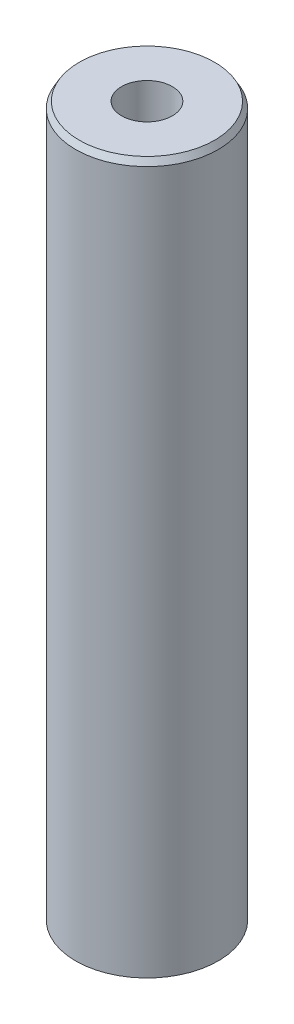
ISO-10303-21;
HEADER;
FILE_DESCRIPTION(('STEP AP214'),'2;1');
FILE_NAME('part.step','',(''),(''),'','','');
FILE_SCHEMA(('AUTOMOTIVE_DESIGN { 1 0 10303 214 1 1 1 1 }'));
ENDSEC;
DATA;
#1=APPLICATION_CONTEXT('core data for automotive mechanical design processes');
#2=APPLICATION_PROTOCOL_DEFINITION('international standard','automotive_design',2000,#1);
#3=PRODUCT_CONTEXT('',#1,'mechanical');
#4=PRODUCT('Part','Part','',(#3));
#5=PRODUCT_RELATED_PRODUCT_CATEGORY('part','',(#4));
#6=PRODUCT_DEFINITION_FORMATION('','',#4);
#7=PRODUCT_DEFINITION_CONTEXT('part definition',#1,'design');
#8=PRODUCT_DEFINITION('design','',#6,#7);
#9=PRODUCT_DEFINITION_SHAPE('','',#8);
#10=(LENGTH_UNIT() NAMED_UNIT(*) SI_UNIT(.MILLI.,.METRE.));
#11=(NAMED_UNIT(*) PLANE_ANGLE_UNIT() SI_UNIT($,.RADIAN.));
#12=(NAMED_UNIT(*) SI_UNIT($,.STERADIAN.) SOLID_ANGLE_UNIT());
#13=UNCERTAINTY_MEASURE_WITH_UNIT(LENGTH_MEASURE(1.E-05),#10,'distance_accuracy_value','');
#14=(GEOMETRIC_REPRESENTATION_CONTEXT(3) GLOBAL_UNCERTAINTY_ASSIGNED_CONTEXT((#13)) GLOBAL_UNIT_ASSIGNED_CONTEXT((#10,
#11,#12)) REPRESENTATION_CONTEXT('',''));
#15=CARTESIAN_POINT('',(0.,0.,0.));
#16=DIRECTION('',(0.,0.,1.));
#17=DIRECTION('',(1.,0.,0.));
#18=AXIS2_PLACEMENT_3D('',#15,#16,#17);
#19=CARTESIAN_POINT('',(0.,600.,0.));
#20=DIRECTION('',(0.,-1.,0.));
#21=DIRECTION('',(0.,0.,-1.));
#22=AXIS2_PLACEMENT_3D('',#19,#20,#21);
#23=CYLINDRICAL_SURFACE('',#22,60.);
#24=CARTESIAN_POINT('',(0.,594.709303964227,0.));
#25=DIRECTION('',(0.,1.,0.));
#26=DIRECTION('',(0.,0.,1.));
#27=AXIS2_PLACEMENT_3D('',#24,#25,#26);
#28=CIRCLE('',#27,60.);
#29=CARTESIAN_POINT('',(0.,594.709303964227,60.));
#30=VERTEX_POINT('',#29);
#31=EDGE_CURVE('E50',#30,#30,#28,.F.);
#32=ORIENTED_EDGE('',*,*,#31,.T.);
#33=EDGE_LOOP('',(#32));
#34=FACE_BOUND('',#33,.T.);
#35=CARTESIAN_POINT('',(0.,3.05458478045362,0.));
#36=DIRECTION('',(0.,1.,0.));
#37=DIRECTION('',(0.,0.,1.));
#38=AXIS2_PLACEMENT_3D('',#35,#36,#37);
#39=CIRCLE('',#38,60.);
#40=CARTESIAN_POINT('',(0.,3.05458478045362,60.));
#41=VERTEX_POINT('',#40);
#42=EDGE_CURVE('E51',#41,#41,#39,.T.);
#43=ORIENTED_EDGE('',*,*,#42,.T.);
#44=EDGE_LOOP('',(#43));
#45=FACE_BOUND('',#44,.T.);
#46=ADVANCED_FACE('F39',(#34,#45),#23,.T.);
#47=CARTESIAN_POINT('',(0.,600.,0.));
#48=DIRECTION('',(0.,1.,0.));
#49=DIRECTION('',(0.,0.,1.));
#50=AXIS2_PLACEMENT_3D('',#47,#48,#49);
#51=PLANE('',#50);
#52=CARTESIAN_POINT('',(0.,600.,0.));
#53=DIRECTION('',(0.,1.,0.));
#54=DIRECTION('',(0.,0.,1.));
#55=AXIS2_PLACEMENT_3D('',#52,#53,#54);
#56=CIRCLE('',#55,56.9454152195462);
#57=CARTESIAN_POINT('',(0.,600.,56.9454152195462));
#58=VERTEX_POINT('',#57);
#59=EDGE_CURVE('E54',#58,#58,#56,.T.);
#60=ORIENTED_EDGE('',*,*,#59,.T.);
#61=EDGE_LOOP('',(#60));
#62=FACE_BOUND('',#61,.T.);
#63=CARTESIAN_POINT('',(0.,600.,0.));
#64=DIRECTION('',(0.,1.,0.));
#65=DIRECTION('',(0.,0.,1.));
#66=AXIS2_PLACEMENT_3D('',#63,#64,#65);
#67=CIRCLE('',#66,21.3816097205668);
#68=CARTESIAN_POINT('',(0.,600.,21.3816097205668));
#69=VERTEX_POINT('',#68);
#70=EDGE_CURVE('E58',#69,#69,#67,.T.);
#71=ORIENTED_EDGE('',*,*,#70,.F.);
#72=EDGE_LOOP('',(#71));
#73=FACE_BOUND('',#72,.T.);
#74=ADVANCED_FACE('F69',(#62,#73),#51,.T.);
#75=CARTESIAN_POINT('',(0.,0.,0.));
#76=DIRECTION('',(0.,1.,0.));
#77=DIRECTION('',(0.,0.,1.));
#78=AXIS2_PLACEMENT_3D('',#75,#76,#77);
#79=PLANE('',#78);
#80=CARTESIAN_POINT('',(0.,0.,0.));
#81=DIRECTION('',(0.,1.,0.));
#82=DIRECTION('',(0.,0.,1.));
#83=AXIS2_PLACEMENT_3D('',#80,#81,#82);
#84=CIRCLE('',#83,54.7093039642276);
#85=CARTESIAN_POINT('',(0.,0.,54.7093039642276));
#86=VERTEX_POINT('',#85);
#87=EDGE_CURVE('E10',#86,#86,#84,.F.);
#88=ORIENTED_EDGE('',*,*,#87,.T.);
#89=EDGE_LOOP('',(#88));
#90=FACE_BOUND('',#89,.T.);
#91=CARTESIAN_POINT('',(0.,0.,0.));
#92=DIRECTION('',(0.,1.,0.));
#93=DIRECTION('',(0.,0.,1.));
#94=AXIS2_PLACEMENT_3D('',#91,#92,#93);
#95=CIRCLE('',#94,21.3816097205668);
#96=CARTESIAN_POINT('',(0.,0.,21.3816097205668));
#97=VERTEX_POINT('',#96);
#98=EDGE_CURVE('E63',#97,#97,#95,.T.);
#99=ORIENTED_EDGE('',*,*,#98,.T.);
#100=EDGE_LOOP('',(#99));
#101=FACE_BOUND('',#100,.T.);
#102=ADVANCED_FACE('F75',(#90,#101),#79,.F.);
#103=CARTESIAN_POINT('',(0.,600.,0.));
#104=DIRECTION('',(0.,-1.,0.));
#105=DIRECTION('',(0.,0.,-1.));
#106=AXIS2_PLACEMENT_3D('',#103,#104,#105);
#107=CYLINDRICAL_SURFACE('',#106,21.3816097205668);
#108=ORIENTED_EDGE('',*,*,#70,.T.);
#109=EDGE_LOOP('',(#108));
#110=FACE_BOUND('',#109,.T.);
#111=ORIENTED_EDGE('',*,*,#98,.F.);
#112=EDGE_LOOP('',(#111));
#113=FACE_BOUND('',#112,.T.);
#114=ADVANCED_FACE('F70',(#110,#113),#107,.F.);
#115=CARTESIAN_POINT('',(0.,600.,0.));
#116=DIRECTION('',(0.,-1.,0.));
#117=DIRECTION('',(0.,0.,-1.));
#118=AXIS2_PLACEMENT_3D('',#115,#116,#117);
#119=CONICAL_SURFACE('',#118,56.9454152195462,0.523598775598298);
#120=ORIENTED_EDGE('',*,*,#31,.F.);
#121=EDGE_LOOP('',(#120));
#122=FACE_BOUND('',#121,.T.);
#123=ORIENTED_EDGE('',*,*,#59,.F.);
#124=EDGE_LOOP('',(#123));
#125=FACE_BOUND('',#124,.T.);
#126=ADVANCED_FACE('F81',(#122,#125),#119,.T.);
#127=CARTESIAN_POINT('',(0.,3.05458478045362,0.));
#128=DIRECTION('',(0.,1.,0.));
#129=DIRECTION('',(0.,0.,1.));
#130=AXIS2_PLACEMENT_3D('',#127,#128,#129);
#131=CONICAL_SURFACE('',#130,60.,1.0471975511966);
#132=ORIENTED_EDGE('',*,*,#87,.F.);
#133=EDGE_LOOP('',(#132));
#134=FACE_BOUND('',#133,.T.);
#135=ORIENTED_EDGE('',*,*,#42,.F.);
#136=EDGE_LOOP('',(#135));
#137=FACE_BOUND('',#136,.T.);
#138=ADVANCED_FACE('F45',(#134,#137),#131,.T.);
#139=CLOSED_SHELL('',(#46,#74,#102,#114,#126,#138));
#140=MANIFOLD_SOLID_BREP('B2',#139);
#141=ADVANCED_BREP_SHAPE_REPRESENTATION('',(#18,#140),#14);
#142=SHAPE_DEFINITION_REPRESENTATION(#9,#141);
ENDSEC;
END-ISO-10303-21;
